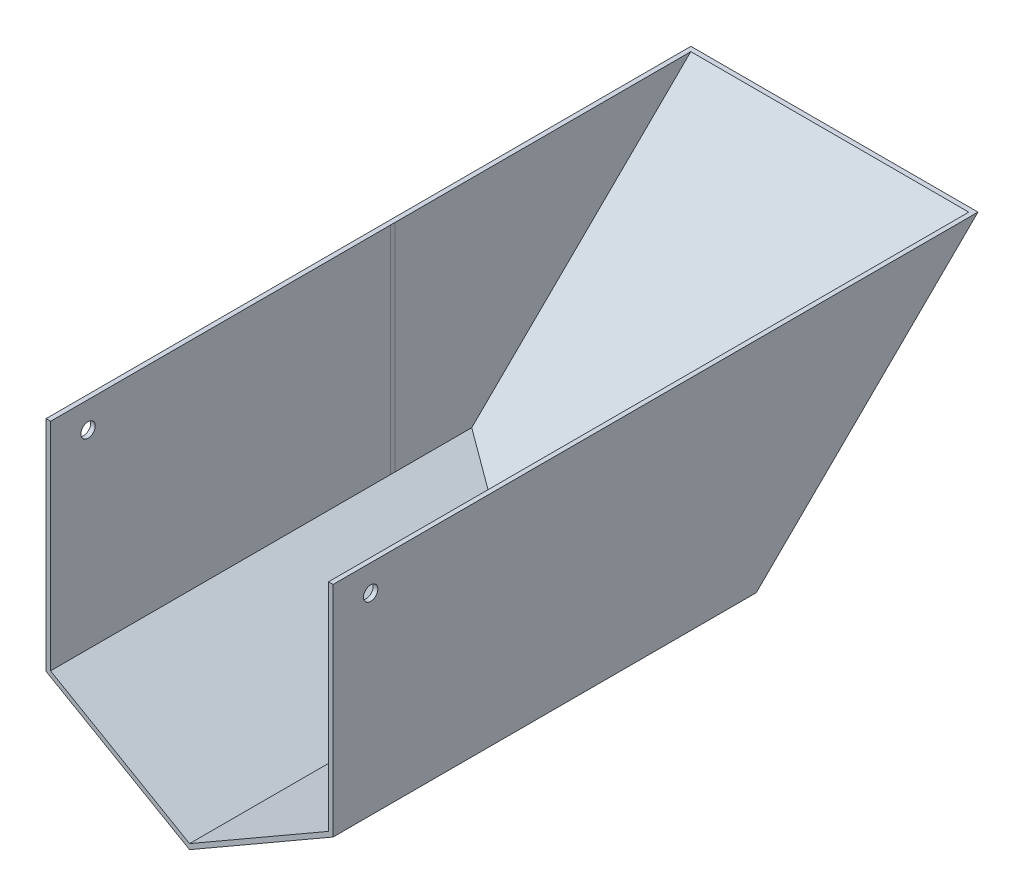
ISO-10303-21;
HEADER;
FILE_DESCRIPTION(('STEP AP214'),'2;1');
FILE_NAME('part.step','',(''),(''),'','','');
FILE_SCHEMA(('AUTOMOTIVE_DESIGN { 1 0 10303 214 1 1 1 1 }'));
ENDSEC;
DATA;
#1=APPLICATION_CONTEXT('core data for automotive mechanical design processes');
#2=APPLICATION_PROTOCOL_DEFINITION('international standard','automotive_design',2000,#1);
#3=PRODUCT_CONTEXT('',#1,'mechanical');
#4=PRODUCT('Part','Part','',(#3));
#5=PRODUCT_RELATED_PRODUCT_CATEGORY('part','',(#4));
#6=PRODUCT_DEFINITION_FORMATION('','',#4);
#7=PRODUCT_DEFINITION_CONTEXT('part definition',#1,'design');
#8=PRODUCT_DEFINITION('design','',#6,#7);
#9=PRODUCT_DEFINITION_SHAPE('','',#8);
#10=(LENGTH_UNIT() NAMED_UNIT(*) SI_UNIT(.MILLI.,.METRE.));
#11=(NAMED_UNIT(*) PLANE_ANGLE_UNIT() SI_UNIT($,.RADIAN.));
#12=(NAMED_UNIT(*) SI_UNIT($,.STERADIAN.) SOLID_ANGLE_UNIT());
#13=UNCERTAINTY_MEASURE_WITH_UNIT(LENGTH_MEASURE(1.E-05),#10,'distance_accuracy_value','');
#14=(GEOMETRIC_REPRESENTATION_CONTEXT(3) GLOBAL_UNCERTAINTY_ASSIGNED_CONTEXT((#13)) GLOBAL_UNIT_ASSIGNED_CONTEXT((#10,
#11,#12)) REPRESENTATION_CONTEXT('',''));
#15=CARTESIAN_POINT('',(0.,0.,0.));
#16=DIRECTION('',(0.,0.,1.));
#17=DIRECTION('',(1.,0.,0.));
#18=AXIS2_PLACEMENT_3D('',#15,#16,#17);
#19=CARTESIAN_POINT('',(-169.587531669356,-13.6920444988387,-13.6173042076226));
#20=DIRECTION('',(0.,0.709039337347486,0.705168928763767));
#21=DIRECTION('',(0.,-0.705168928763767,0.709039337347486));
#22=AXIS2_PLACEMENT_3D('',#19,#20,#21);
#23=PLANE('',#22);
#24=DIRECTION('',(0.774322786925713,-0.44622442454353,0.448673583564257));
#25=VECTOR('',#24,1.);
#26=CARTESIAN_POINT('',(-92.1667034302843,53.113552764654,-80.7895724155405));
#27=LINE('',#26,#25);
#28=CARTESIAN_POINT('',(0.,0.,-27.3844992191901));
#29=VERTEX_POINT('',#28);
#30=CARTESIAN_POINT('',(50.,-28.8138507659816,1.58749999999999));
#31=VERTEX_POINT('',#30);
#32=EDGE_CURVE('E171',#29,#31,#27,.T.);
#33=ORIENTED_EDGE('',*,*,#32,.F.);
#34=DIRECTION('',(1.,0.,0.));
#35=VECTOR('',#34,1.);
#36=CARTESIAN_POINT('',(-169.587531669356,0.,-27.38449921919));
#37=LINE('',#36,#35);
#38=CARTESIAN_POINT('',(100.,0.,-27.3844992191901));
#39=VERTEX_POINT('',#38);
#40=EDGE_CURVE('E185',#29,#39,#37,.T.);
#41=ORIENTED_EDGE('',*,*,#40,.T.);
#42=DIRECTION('',(0.774322786925713,0.44622442454353,-0.448673583564257));
#43=VECTOR('',#42,1.);
#44=CARTESIAN_POINT('',(-71.1520270039896,-98.6309792877644,71.7878286352577));
#45=LINE('',#44,#43);
#46=EDGE_CURVE('E188',#31,#39,#45,.T.);
#47=ORIENTED_EDGE('',*,*,#46,.F.);
#48=EDGE_LOOP('',(#33,#41,#47));
#49=FACE_BOUND('',#48,.T.);
#50=ADVANCED_FACE('F66',(#49),#23,.F.);
#51=CARTESIAN_POINT('',(0.,76.2,0.));
#52=DIRECTION('',(1.,0.,0.));
#53=DIRECTION('',(0.,0.,-1.));
#54=AXIS2_PLACEMENT_3D('',#51,#52,#53);
#55=PLANE('',#54);
#56=CARTESIAN_POINT('',(0.,67.0395726277491,106.931013831932));
#57=DIRECTION('',(-1.,0.,0.));
#58=DIRECTION('',(0.,0.,1.));
#59=AXIS2_PLACEMENT_3D('',#56,#57,#58);
#60=CIRCLE('',#59,2.5);
#61=CARTESIAN_POINT('',(0.,67.0395726277491,109.431013831932));
#62=VERTEX_POINT('',#61);
#63=EDGE_CURVE('E389',#62,#62,#60,.T.);
#64=ORIENTED_EDGE('',*,*,#63,.F.);
#65=EDGE_LOOP('',(#64));
#66=FACE_BOUND('',#65,.T.);
#67=DIRECTION('',(0.,-0.702310217451551,0.711871026565315));
#68=VECTOR('',#67,1.);
#69=CARTESIAN_POINT('',(0.,-13.6909980137796,-13.5071205785393));
#70=LINE('',#69,#68);
#71=CARTESIAN_POINT('',(0.,76.2,-104.621838042356));
#72=VERTEX_POINT('',#71);
#73=EDGE_CURVE('E193',#72,#29,#70,.T.);
#74=ORIENTED_EDGE('',*,*,#73,.T.);
#75=DIRECTION('',(0.,0.,1.));
#76=VECTOR('',#75,1.);
#77=CARTESIAN_POINT('',(0.,0.,0.));
#78=LINE('',#77,#76);
#79=CARTESIAN_POINT('',(0.,0.,120.));
#80=VERTEX_POINT('',#79);
#81=EDGE_CURVE('E168',#29,#80,#78,.T.);
#82=ORIENTED_EDGE('',*,*,#81,.T.);
#83=DIRECTION('',(0.,-1.,0.));
#84=VECTOR('',#83,1.);
#85=CARTESIAN_POINT('',(0.,76.2,120.));
#86=LINE('',#85,#84);
#87=CARTESIAN_POINT('',(0.,76.2,120.));
#88=VERTEX_POINT('',#87);
#89=EDGE_CURVE('E249',#88,#80,#86,.T.);
#90=ORIENTED_EDGE('',*,*,#89,.F.);
#91=DIRECTION('',(0.,0.,1.));
#92=VECTOR('',#91,1.);
#93=CARTESIAN_POINT('',(0.,76.2,0.));
#94=LINE('',#93,#92);
#95=EDGE_CURVE('E195',#72,#88,#94,.T.);
#96=ORIENTED_EDGE('',*,*,#95,.F.);
#97=EDGE_LOOP('',(#74,#82,#90,#96));
#98=FACE_BOUND('',#97,.T.);
#99=ADVANCED_FACE('F194',(#66,#98),#55,.F.);
#100=CARTESIAN_POINT('',(100.,76.2,0.));
#101=DIRECTION('',(1.,0.,0.));
#102=DIRECTION('',(0.,0.,-1.));
#103=AXIS2_PLACEMENT_3D('',#100,#101,#102);
#104=PLANE('',#103);
#105=CARTESIAN_POINT('',(100.,67.0395726277491,106.931013831932));
#106=DIRECTION('',(1.,0.,0.));
#107=DIRECTION('',(0.,0.,-1.));
#108=AXIS2_PLACEMENT_3D('',#105,#106,#107);
#109=CIRCLE('',#108,2.5);
#110=CARTESIAN_POINT('',(100.,67.0395726277491,104.431013831932));
#111=VERTEX_POINT('',#110);
#112=EDGE_CURVE('E190',#111,#111,#109,.T.);
#113=ORIENTED_EDGE('',*,*,#112,.F.);
#114=EDGE_LOOP('',(#113));
#115=FACE_BOUND('',#114,.T.);
#116=DIRECTION('',(0.,0.,1.));
#117=VECTOR('',#116,1.);
#118=CARTESIAN_POINT('',(100.,0.,0.));
#119=LINE('',#118,#117);
#120=CARTESIAN_POINT('',(100.,0.,120.));
#121=VERTEX_POINT('',#120);
#122=EDGE_CURVE('E180',#39,#121,#119,.T.);
#123=ORIENTED_EDGE('',*,*,#122,.F.);
#124=DIRECTION('',(0.,0.702310217451551,-0.711871026565315));
#125=VECTOR('',#124,1.);
#126=CARTESIAN_POINT('',(100.,-13.6909980137796,-13.5071205785393));
#127=LINE('',#126,#125);
#128=CARTESIAN_POINT('',(100.,76.2,-104.621838042356));
#129=VERTEX_POINT('',#128);
#130=EDGE_CURVE('E201',#39,#129,#127,.T.);
#131=ORIENTED_EDGE('',*,*,#130,.T.);
#132=DIRECTION('',(0.,0.,1.));
#133=VECTOR('',#132,1.);
#134=CARTESIAN_POINT('',(100.,76.2,0.));
#135=LINE('',#134,#133);
#136=CARTESIAN_POINT('',(100.,76.2,120.));
#137=VERTEX_POINT('',#136);
#138=EDGE_CURVE('E82',#129,#137,#135,.T.);
#139=ORIENTED_EDGE('',*,*,#138,.T.);
#140=DIRECTION('',(0.,-1.,0.));
#141=VECTOR('',#140,1.);
#142=CARTESIAN_POINT('',(100.,76.2,120.));
#143=LINE('',#142,#141);
#144=EDGE_CURVE('E251',#137,#121,#143,.T.);
#145=ORIENTED_EDGE('',*,*,#144,.T.);
#146=EDGE_LOOP('',(#123,#131,#139,#145));
#147=FACE_BOUND('',#146,.T.);
#148=ADVANCED_FACE('F345',(#115,#147),#104,.T.);
#149=CARTESIAN_POINT('',(0.,0.917396041729078,-139.495251105349));
#150=DIRECTION('',(0.,-1.,0.));
#151=DIRECTION('',(0.,0.,-1.));
#152=AXIS2_PLACEMENT_3D('',#149,#150,#151);
#153=PLANE('',#152);
#154=DIRECTION('',(-1.,0.,0.));
#155=VECTOR('',#154,1.);
#156=CARTESIAN_POINT('',(1.5875,0.917396041729078,0.));
#157=LINE('',#156,#155);
#158=CARTESIAN_POINT('',(1.5875,0.917396041729084,0.));
#159=VERTEX_POINT('',#158);
#160=CARTESIAN_POINT('',(1.58732545100904,0.917396041729079,0.));
#161=VERTEX_POINT('',#160);
#162=EDGE_CURVE('E291',#159,#161,#157,.T.);
#163=ORIENTED_EDGE('',*,*,#162,.T.);
#164=DIRECTION('',(0.,0.,1.));
#165=VECTOR('',#164,1.);
#166=CARTESIAN_POINT('',(1.58732545100904,0.917396041729079,1.5875));
#167=LINE('',#166,#165);
#168=CARTESIAN_POINT('',(1.58732545100904,0.917396041729079,1.5875));
#169=VERTEX_POINT('',#168);
#170=EDGE_CURVE('E203',#161,#169,#167,.T.);
#171=ORIENTED_EDGE('',*,*,#170,.T.);
#172=DIRECTION('',(1.,0.,0.));
#173=VECTOR('',#172,1.);
#174=CARTESIAN_POINT('',(0.,0.917396041729078,1.5875));
#175=LINE('',#174,#173);
#176=CARTESIAN_POINT('',(1.5875,0.917396041729078,1.58750000000001));
#177=VERTEX_POINT('',#176);
#178=EDGE_CURVE('E293',#169,#177,#175,.T.);
#179=ORIENTED_EDGE('',*,*,#178,.T.);
#180=DIRECTION('',(0.,0.,1.));
#181=VECTOR('',#180,1.);
#182=CARTESIAN_POINT('',(1.5875,0.917396041729084,-139.495251105349));
#183=LINE('',#182,#181);
#184=EDGE_CURVE('E90',#159,#177,#183,.T.);
#185=ORIENTED_EDGE('',*,*,#184,.F.);
#186=EDGE_LOOP('',(#163,#171,#179,#185));
#187=FACE_BOUND('',#186,.T.);
#188=ADVANCED_FACE('F301',(#187),#153,.F.);
#189=CARTESIAN_POINT('',(1.5875,76.2,1.5875));
#190=DIRECTION('',(0.,0.,-1.));
#191=DIRECTION('',(-1.,0.,0.));
#192=AXIS2_PLACEMENT_3D('',#189,#190,#191);
#193=PLANE('',#192);
#194=DIRECTION('',(0.,-1.,0.));
#195=VECTOR('',#194,1.);
#196=CARTESIAN_POINT('',(1.5875,76.2,1.5875));
#197=LINE('',#196,#195);
#198=CARTESIAN_POINT('',(1.58750000000001,76.2,1.5875));
#199=VERTEX_POINT('',#198);
#200=EDGE_CURVE('E242',#199,#177,#197,.T.);
#201=ORIENTED_EDGE('',*,*,#200,.T.);
#202=ORIENTED_EDGE('',*,*,#178,.F.);
#203=DIRECTION('',(0.,1.,0.));
#204=VECTOR('',#203,1.);
#205=CARTESIAN_POINT('',(1.58732545100904,-96.8381876260216,1.5875));
#206=LINE('',#205,#204);
#207=CARTESIAN_POINT('',(1.58732545100904,76.2,1.5875));
#208=VERTEX_POINT('',#207);
#209=EDGE_CURVE('E211',#169,#208,#206,.T.);
#210=ORIENTED_EDGE('',*,*,#209,.T.);
#211=DIRECTION('',(1.,0.,0.));
#212=VECTOR('',#211,1.);
#213=CARTESIAN_POINT('',(98.4125,76.2,1.5875));
#214=LINE('',#213,#212);
#215=EDGE_CURVE('E206',#208,#199,#214,.T.);
#216=ORIENTED_EDGE('',*,*,#215,.T.);
#217=EDGE_LOOP('',(#201,#202,#210,#216));
#218=FACE_BOUND('',#217,.T.);
#219=ADVANCED_FACE('F317',(#218),#193,.T.);
#220=CARTESIAN_POINT('',(98.4125,76.2,118.4125));
#221=DIRECTION('',(1.,0.,0.));
#222=DIRECTION('',(0.,0.,-1.));
#223=AXIS2_PLACEMENT_3D('',#220,#221,#222);
#224=PLANE('',#223);
#225=CARTESIAN_POINT('',(98.4125,67.0395726277491,106.931013831932));
#226=DIRECTION('',(1.,0.,0.));
#227=DIRECTION('',(0.,0.,-1.));
#228=AXIS2_PLACEMENT_3D('',#225,#226,#227);
#229=CIRCLE('',#228,2.5);
#230=CARTESIAN_POINT('',(98.4125,67.0395726277491,104.431013831932));
#231=VERTEX_POINT('',#230);
#232=EDGE_CURVE('E386',#231,#231,#229,.T.);
#233=ORIENTED_EDGE('',*,*,#232,.T.);
#234=EDGE_LOOP('',(#233));
#235=FACE_BOUND('',#234,.T.);
#236=DIRECTION('',(0.,0.,1.));
#237=VECTOR('',#236,1.);
#238=CARTESIAN_POINT('',(98.4125,76.2,1.5875));
#239=LINE('',#238,#237);
#240=CARTESIAN_POINT('',(98.4125,76.2,-102.998764503608));
#241=VERTEX_POINT('',#240);
#242=CARTESIAN_POINT('',(98.4125,76.2,120.));
#243=VERTEX_POINT('',#242);
#244=EDGE_CURVE('E179',#241,#243,#239,.T.);
#245=ORIENTED_EDGE('',*,*,#244,.F.);
#246=DIRECTION('',(0.,0.702310217451551,-0.711871026565315));
#247=VECTOR('',#246,1.);
#248=CARTESIAN_POINT('',(98.4125,76.2,-102.998764503608));
#249=LINE('',#248,#247);
#250=CARTESIAN_POINT('',(98.4125,0.917396041729218,-26.6913105742742));
#251=VERTEX_POINT('',#250);
#252=EDGE_CURVE('E276',#251,#241,#249,.T.);
#253=ORIENTED_EDGE('',*,*,#252,.F.);
#254=DIRECTION('',(0.,0.,1.));
#255=VECTOR('',#254,1.);
#256=CARTESIAN_POINT('',(98.4125,0.917396041729093,-102.738657011274));
#257=LINE('',#256,#255);
#258=CARTESIAN_POINT('',(98.4125,0.917396041729112,120.));
#259=VERTEX_POINT('',#258);
#260=EDGE_CURVE('E226',#251,#259,#257,.T.);
#261=ORIENTED_EDGE('',*,*,#260,.T.);
#262=DIRECTION('',(0.,-1.,0.));
#263=VECTOR('',#262,1.);
#264=CARTESIAN_POINT('',(98.4125,76.2,120.));
#265=LINE('',#264,#263);
#266=EDGE_CURVE('E254',#243,#259,#265,.T.);
#267=ORIENTED_EDGE('',*,*,#266,.F.);
#268=EDGE_LOOP('',(#245,#253,#261,#267));
#269=FACE_BOUND('',#268,.T.);
#270=ADVANCED_FACE('F68',(#235,#269),#224,.F.);
#271=CARTESIAN_POINT('',(1.58732545100904,-96.8381876260216,1.5875));
#272=DIRECTION('',(-1.,0.,0.));
#273=DIRECTION('',(0.,0.,1.));
#274=AXIS2_PLACEMENT_3D('',#271,#272,#273);
#275=PLANE('',#274);
#276=ORIENTED_EDGE('',*,*,#170,.F.);
#277=DIRECTION('',(0.,1.,0.));
#278=VECTOR('',#277,1.);
#279=CARTESIAN_POINT('',(1.58732545100904,-96.8381876260216,0.));
#280=LINE('',#279,#278);
#281=CARTESIAN_POINT('',(1.58732545100904,76.2,0.));
#282=VERTEX_POINT('',#281);
#283=EDGE_CURVE('E208',#161,#282,#280,.T.);
#284=ORIENTED_EDGE('',*,*,#283,.T.);
#285=DIRECTION('',(0.,0.,1.));
#286=VECTOR('',#285,1.);
#287=CARTESIAN_POINT('',(1.58732545100904,76.2,1.5875));
#288=LINE('',#287,#286);
#289=EDGE_CURVE('E197',#282,#208,#288,.T.);
#290=ORIENTED_EDGE('',*,*,#289,.T.);
#291=ORIENTED_EDGE('',*,*,#209,.F.);
#292=EDGE_LOOP('',(#276,#284,#290,#291));
#293=FACE_BOUND('',#292,.T.);
#294=ADVANCED_FACE('F306',(#293),#275,.F.);
#295=CARTESIAN_POINT('',(-169.587531669356,-12.8795354262273,-12.7065563680989));
#296=DIRECTION('',(0.,-0.711871026565315,-0.702310217451551));
#297=DIRECTION('',(0.,0.702310217451551,-0.711871026565315));
#298=AXIS2_PLACEMENT_3D('',#295,#296,#297);
#299=PLANE('',#298);
#300=ORIENTED_EDGE('',*,*,#252,.T.);
#301=DIRECTION('',(-1.,0.,0.));
#302=VECTOR('',#301,1.);
#303=CARTESIAN_POINT('',(-169.587531669356,76.2,-102.998764503607));
#304=LINE('',#303,#302);
#305=CARTESIAN_POINT('',(1.58749999999999,76.2,-102.998764503608));
#306=VERTEX_POINT('',#305);
#307=EDGE_CURVE('E278',#241,#306,#304,.T.);
#308=ORIENTED_EDGE('',*,*,#307,.T.);
#309=DIRECTION('',(0.,0.702310217451551,-0.711871026565315));
#310=VECTOR('',#309,1.);
#311=CARTESIAN_POINT('',(1.5875,-12.8795354262273,-12.7065563680989));
#312=LINE('',#311,#310);
#313=CARTESIAN_POINT('',(1.58749999999999,0.917396041729079,-26.6913105742741));
#314=VERTEX_POINT('',#313);
#315=EDGE_CURVE('E264',#314,#306,#312,.T.);
#316=ORIENTED_EDGE('',*,*,#315,.F.);
#317=DIRECTION('',(0.773061237349537,-0.445497422519093,0.45156214393641));
#318=VECTOR('',#317,1.);
#319=CARTESIAN_POINT('',(-91.0772623174427,54.3179686953282,-80.8188450020581));
#320=LINE('',#319,#318);
#321=CARTESIAN_POINT('',(50.,-26.9816149624327,1.5875));
#322=VERTEX_POINT('',#321);
#323=EDGE_CURVE('E75',#314,#322,#320,.T.);
#324=ORIENTED_EDGE('',*,*,#323,.T.);
#325=DIRECTION('',(-0.773061237349536,-0.445497422519094,0.451562143936411));
#326=VECTOR('',#325,1.);
#327=CARTESIAN_POINT('',(-71.3841537466541,-96.9325127906541,72.4906653089635));
#328=LINE('',#327,#326);
#329=EDGE_CURVE('E12',#251,#322,#328,.T.);
#330=ORIENTED_EDGE('',*,*,#329,.F.);
#331=EDGE_LOOP('',(#300,#308,#316,#324,#330));
#332=FACE_BOUND('',#331,.T.);
#333=ADVANCED_FACE('F262',(#332),#299,.F.);
#334=CARTESIAN_POINT('',(1.5875,76.2,1.5875));
#335=DIRECTION('',(1.,0.,0.));
#336=DIRECTION('',(0.,0.,-1.));
#337=AXIS2_PLACEMENT_3D('',#334,#335,#336);
#338=PLANE('',#337);
#339=CARTESIAN_POINT('',(1.58750000000002,67.0395726277491,106.931013831932));
#340=DIRECTION('',(1.,0.,0.));
#341=DIRECTION('',(0.,0.,-1.));
#342=AXIS2_PLACEMENT_3D('',#339,#340,#341);
#343=CIRCLE('',#342,2.5);
#344=CARTESIAN_POINT('',(1.58750000000002,67.0395726277491,104.431013831932));
#345=VERTEX_POINT('',#344);
#346=EDGE_CURVE('E70',#345,#345,#343,.T.);
#347=ORIENTED_EDGE('',*,*,#346,.F.);
#348=EDGE_LOOP('',(#347));
#349=FACE_BOUND('',#348,.T.);
#350=DIRECTION('',(0.,-1.,0.));
#351=VECTOR('',#350,1.);
#352=CARTESIAN_POINT('',(1.5875,76.2,120.));
#353=LINE('',#352,#351);
#354=CARTESIAN_POINT('',(1.5875,76.2,120.));
#355=VERTEX_POINT('',#354);
#356=CARTESIAN_POINT('',(1.5875,0.917396041729078,120.));
#357=VERTEX_POINT('',#356);
#358=EDGE_CURVE('E246',#355,#357,#353,.T.);
#359=ORIENTED_EDGE('',*,*,#358,.T.);
#360=DIRECTION('',(0.,0.,1.));
#361=VECTOR('',#360,1.);
#362=CARTESIAN_POINT('',(1.5875,0.917396041729078,-102.738657011274));
#363=LINE('',#362,#361);
#364=EDGE_CURVE('E221',#177,#357,#363,.T.);
#365=ORIENTED_EDGE('',*,*,#364,.F.);
#366=ORIENTED_EDGE('',*,*,#200,.F.);
#367=DIRECTION('',(0.,0.,1.));
#368=VECTOR('',#367,1.);
#369=CARTESIAN_POINT('',(1.5875,76.2,118.4125));
#370=LINE('',#369,#368);
#371=EDGE_CURVE('E239',#199,#355,#370,.T.);
#372=ORIENTED_EDGE('',*,*,#371,.T.);
#373=EDGE_LOOP('',(#359,#365,#366,#372));
#374=FACE_BOUND('',#373,.T.);
#375=ADVANCED_FACE('F320',(#349,#374),#338,.T.);
#376=CARTESIAN_POINT('',(0.,76.2,120.));
#377=DIRECTION('',(0.,0.,-1.));
#378=DIRECTION('',(-1.,0.,0.));
#379=AXIS2_PLACEMENT_3D('',#376,#377,#378);
#380=PLANE('',#379);
#381=DIRECTION('',(-0.866427780160762,0.499302415141059,0.));
#382=VECTOR('',#381,1.);
#383=CARTESIAN_POINT('',(50.,-26.9816149624327,120.));
#384=LINE('',#383,#382);
#385=CARTESIAN_POINT('',(50.,-26.9816149624327,120.));
#386=VERTEX_POINT('',#385);
#387=EDGE_CURVE('E213',#386,#357,#384,.T.);
#388=ORIENTED_EDGE('',*,*,#387,.T.);
#389=ORIENTED_EDGE('',*,*,#358,.F.);
#390=DIRECTION('',(1.,0.,0.));
#391=VECTOR('',#390,1.);
#392=CARTESIAN_POINT('',(0.,76.2,120.));
#393=LINE('',#392,#391);
#394=EDGE_CURVE('E237',#88,#355,#393,.T.);
#395=ORIENTED_EDGE('',*,*,#394,.F.);
#396=ORIENTED_EDGE('',*,*,#89,.T.);
#397=DIRECTION('',(0.866427780160762,-0.499302415141059,0.));
#398=VECTOR('',#397,1.);
#399=CARTESIAN_POINT('',(0.,0.,120.));
#400=LINE('',#399,#398);
#401=CARTESIAN_POINT('',(50.,-28.8138507659816,120.));
#402=VERTEX_POINT('',#401);
#403=EDGE_CURVE('E174',#80,#402,#400,.T.);
#404=ORIENTED_EDGE('',*,*,#403,.T.);
#405=DIRECTION('',(0.866427780160762,0.499302415141059,0.));
#406=VECTOR('',#405,1.);
#407=CARTESIAN_POINT('',(50.,-28.8138507659816,120.));
#408=LINE('',#407,#406);
#409=EDGE_CURVE('E218',#402,#121,#408,.T.);
#410=ORIENTED_EDGE('',*,*,#409,.T.);
#411=ORIENTED_EDGE('',*,*,#144,.F.);
#412=DIRECTION('',(1.,0.,0.));
#413=VECTOR('',#412,1.);
#414=CARTESIAN_POINT('',(98.4125,76.2,120.));
#415=LINE('',#414,#413);
#416=EDGE_CURVE('E233',#243,#137,#415,.T.);
#417=ORIENTED_EDGE('',*,*,#416,.F.);
#418=ORIENTED_EDGE('',*,*,#266,.T.);
#419=DIRECTION('',(0.866427780160761,0.49930241514106,0.));
#420=VECTOR('',#419,1.);
#421=CARTESIAN_POINT('',(50.,-26.9816149624327,120.));
#422=LINE('',#421,#420);
#423=EDGE_CURVE('E222',#386,#259,#422,.T.);
#424=ORIENTED_EDGE('',*,*,#423,.F.);
#425=EDGE_LOOP('',(#388,#389,#395,#396,#404,#410,#411,#417,#418,#424));
#426=FACE_BOUND('',#425,.T.);
#427=ADVANCED_FACE('F323',(#426),#380,.F.);
#428=CARTESIAN_POINT('',(0.,76.2,0.));
#429=DIRECTION('',(0.,-1.,0.));
#430=DIRECTION('',(0.,0.,-1.));
#431=AXIS2_PLACEMENT_3D('',#428,#429,#430);
#432=PLANE('',#431);
#433=ORIENTED_EDGE('',*,*,#138,.F.);
#434=DIRECTION('',(-1.,0.,0.));
#435=VECTOR('',#434,1.);
#436=CARTESIAN_POINT('',(-169.587531669356,76.2,-104.621838042356));
#437=LINE('',#436,#435);
#438=EDGE_CURVE('E283',#129,#72,#437,.T.);
#439=ORIENTED_EDGE('',*,*,#438,.T.);
#440=ORIENTED_EDGE('',*,*,#95,.T.);
#441=ORIENTED_EDGE('',*,*,#394,.T.);
#442=ORIENTED_EDGE('',*,*,#371,.F.);
#443=ORIENTED_EDGE('',*,*,#215,.F.);
#444=ORIENTED_EDGE('',*,*,#289,.F.);
#445=DIRECTION('',(-1.,0.,0.));
#446=VECTOR('',#445,1.);
#447=CARTESIAN_POINT('',(1.5875,76.2,0.));
#448=LINE('',#447,#446);
#449=CARTESIAN_POINT('',(1.5875,76.2,0.));
#450=VERTEX_POINT('',#449);
#451=EDGE_CURVE('E290',#450,#282,#448,.T.);
#452=ORIENTED_EDGE('',*,*,#451,.F.);
#453=DIRECTION('',(0.,0.,-1.));
#454=VECTOR('',#453,1.);
#455=CARTESIAN_POINT('',(1.5875,76.2,0.));
#456=LINE('',#455,#454);
#457=EDGE_CURVE('E281',#450,#306,#456,.T.);
#458=ORIENTED_EDGE('',*,*,#457,.T.);
#459=ORIENTED_EDGE('',*,*,#307,.F.);
#460=ORIENTED_EDGE('',*,*,#244,.T.);
#461=ORIENTED_EDGE('',*,*,#416,.T.);
#462=EDGE_LOOP('',(#433,#439,#440,#441,#442,#443,#444,#452,#458,#459,#460,#461));
#463=FACE_BOUND('',#462,.T.);
#464=ADVANCED_FACE('F312',(#463),#432,.F.);
#465=CARTESIAN_POINT('',(50.,-26.9816149624327,-102.738657011274));
#466=DIRECTION('',(0.499302415141059,0.866427780160762,0.));
#467=DIRECTION('',(-0.866427780160762,0.499302415141059,0.));
#468=AXIS2_PLACEMENT_3D('',#465,#466,#467);
#469=PLANE('',#468);
#470=DIRECTION('',(0.,0.,1.));
#471=VECTOR('',#470,1.);
#472=CARTESIAN_POINT('',(50.,-26.9816149624327,-102.738657011274));
#473=LINE('',#472,#471);
#474=EDGE_CURVE('E225',#322,#386,#473,.T.);
#475=ORIENTED_EDGE('',*,*,#474,.F.);
#476=ORIENTED_EDGE('',*,*,#323,.F.);
#477=EDGE_CURVE('E297',#314,#159,#183,.T.);
#478=ORIENTED_EDGE('',*,*,#477,.T.);
#479=ORIENTED_EDGE('',*,*,#184,.T.);
#480=ORIENTED_EDGE('',*,*,#364,.T.);
#481=ORIENTED_EDGE('',*,*,#387,.F.);
#482=EDGE_LOOP('',(#475,#476,#478,#479,#480,#481));
#483=FACE_BOUND('',#482,.T.);
#484=ADVANCED_FACE('F268',(#483),#469,.T.);
#485=CARTESIAN_POINT('',(0.,0.,-102.738657011274));
#486=DIRECTION('',(-0.499302415141059,-0.866427780160762,0.));
#487=DIRECTION('',(0.866427780160762,-0.499302415141059,0.));
#488=AXIS2_PLACEMENT_3D('',#485,#486,#487);
#489=PLANE('',#488);
#490=ORIENTED_EDGE('',*,*,#403,.F.);
#491=ORIENTED_EDGE('',*,*,#81,.F.);
#492=ORIENTED_EDGE('',*,*,#32,.T.);
#493=DIRECTION('',(0.,0.,1.));
#494=VECTOR('',#493,1.);
#495=CARTESIAN_POINT('',(50.,-28.8138507659816,-102.738657011274));
#496=LINE('',#495,#494);
#497=EDGE_CURVE('E228',#31,#402,#496,.T.);
#498=ORIENTED_EDGE('',*,*,#497,.T.);
#499=EDGE_LOOP('',(#490,#491,#492,#498));
#500=FACE_BOUND('',#499,.T.);
#501=ADVANCED_FACE('F170',(#500),#489,.T.);
#502=CARTESIAN_POINT('',(50.,-28.8138507659816,-102.738657011274));
#503=DIRECTION('',(0.499302415141059,-0.866427780160762,0.));
#504=DIRECTION('',(0.866427780160762,0.499302415141059,0.));
#505=AXIS2_PLACEMENT_3D('',#502,#503,#504);
#506=PLANE('',#505);
#507=ORIENTED_EDGE('',*,*,#46,.T.);
#508=ORIENTED_EDGE('',*,*,#122,.T.);
#509=ORIENTED_EDGE('',*,*,#409,.F.);
#510=ORIENTED_EDGE('',*,*,#497,.F.);
#511=EDGE_LOOP('',(#507,#508,#509,#510));
#512=FACE_BOUND('',#511,.T.);
#513=ADVANCED_FACE('F358',(#512),#506,.T.);
#514=CARTESIAN_POINT('',(50.,-26.9816149624327,-102.738657011274));
#515=DIRECTION('',(0.49930241514106,-0.866427780160761,0.));
#516=DIRECTION('',(0.866427780160761,0.49930241514106,0.));
#517=AXIS2_PLACEMENT_3D('',#514,#515,#516);
#518=PLANE('',#517);
#519=ORIENTED_EDGE('',*,*,#260,.F.);
#520=ORIENTED_EDGE('',*,*,#329,.T.);
#521=ORIENTED_EDGE('',*,*,#474,.T.);
#522=ORIENTED_EDGE('',*,*,#423,.T.);
#523=EDGE_LOOP('',(#519,#520,#521,#522));
#524=FACE_BOUND('',#523,.T.);
#525=ADVANCED_FACE('F271',(#524),#518,.F.);
#526=CARTESIAN_POINT('',(-169.587531669356,-13.6909980137796,-13.5071205785393));
#527=DIRECTION('',(0.,-0.711871026565315,-0.702310217451551));
#528=DIRECTION('',(0.,0.702310217451551,-0.711871026565315));
#529=AXIS2_PLACEMENT_3D('',#526,#527,#528);
#530=PLANE('',#529);
#531=ORIENTED_EDGE('',*,*,#438,.F.);
#532=ORIENTED_EDGE('',*,*,#130,.F.);
#533=ORIENTED_EDGE('',*,*,#40,.F.);
#534=ORIENTED_EDGE('',*,*,#73,.F.);
#535=EDGE_LOOP('',(#531,#532,#533,#534));
#536=FACE_BOUND('',#535,.T.);
#537=ADVANCED_FACE('F199',(#536),#530,.T.);
#538=CARTESIAN_POINT('',(1.5875,0.,0.));
#539=DIRECTION('',(0.,0.,-1.));
#540=DIRECTION('',(-1.,0.,0.));
#541=AXIS2_PLACEMENT_3D('',#538,#539,#540);
#542=PLANE('',#541);
#543=ORIENTED_EDGE('',*,*,#451,.T.);
#544=ORIENTED_EDGE('',*,*,#283,.F.);
#545=ORIENTED_EDGE('',*,*,#162,.F.);
#546=DIRECTION('',(0.,-1.,0.));
#547=VECTOR('',#546,1.);
#548=CARTESIAN_POINT('',(1.5875,0.,0.));
#549=LINE('',#548,#547);
#550=EDGE_CURVE('E277',#450,#159,#549,.T.);
#551=ORIENTED_EDGE('',*,*,#550,.F.);
#552=EDGE_LOOP('',(#543,#544,#545,#551));
#553=FACE_BOUND('',#552,.T.);
#554=ADVANCED_FACE('F309',(#553),#542,.F.);
#555=CARTESIAN_POINT('',(1.5875,0.,0.));
#556=DIRECTION('',(-1.,0.,0.));
#557=DIRECTION('',(0.,0.,1.));
#558=AXIS2_PLACEMENT_3D('',#555,#556,#557);
#559=PLANE('',#558);
#560=ORIENTED_EDGE('',*,*,#550,.T.);
#561=ORIENTED_EDGE('',*,*,#477,.F.);
#562=ORIENTED_EDGE('',*,*,#315,.T.);
#563=ORIENTED_EDGE('',*,*,#457,.F.);
#564=EDGE_LOOP('',(#560,#561,#562,#563));
#565=FACE_BOUND('',#564,.T.);
#566=ADVANCED_FACE('F328',(#565),#559,.F.);
#567=CARTESIAN_POINT('',(264.5875,67.0395726277491,106.931013831932));
#568=DIRECTION('',(-1.,0.,0.));
#569=DIRECTION('',(0.,0.,1.));
#570=AXIS2_PLACEMENT_3D('',#567,#568,#569);
#571=CYLINDRICAL_SURFACE('',#570,2.5);
#572=ORIENTED_EDGE('',*,*,#346,.T.);
#573=EDGE_LOOP('',(#572));
#574=FACE_BOUND('',#573,.T.);
#575=ORIENTED_EDGE('',*,*,#63,.T.);
#576=EDGE_LOOP('',(#575));
#577=FACE_BOUND('',#576,.T.);
#578=ADVANCED_FACE('F330',(#574,#577),#571,.F.);
#579=ORIENTED_EDGE('',*,*,#112,.T.);
#580=EDGE_LOOP('',(#579));
#581=FACE_BOUND('',#580,.T.);
#582=ORIENTED_EDGE('',*,*,#232,.F.);
#583=EDGE_LOOP('',(#582));
#584=FACE_BOUND('',#583,.T.);
#585=ADVANCED_FACE('F336',(#581,#584),#571,.F.);
#586=CLOSED_SHELL('',(#50,#99,#148,#188,#219,#270,#294,#333,#375,#427,#464,#484,#501,#513,#525,
#537,#554,#566,#578,#585));
#587=MANIFOLD_SOLID_BREP('B2',#586);
#588=ADVANCED_BREP_SHAPE_REPRESENTATION('',(#18,#587),#14);
#589=SHAPE_DEFINITION_REPRESENTATION(#9,#588);
ENDSEC;
END-ISO-10303-21;
